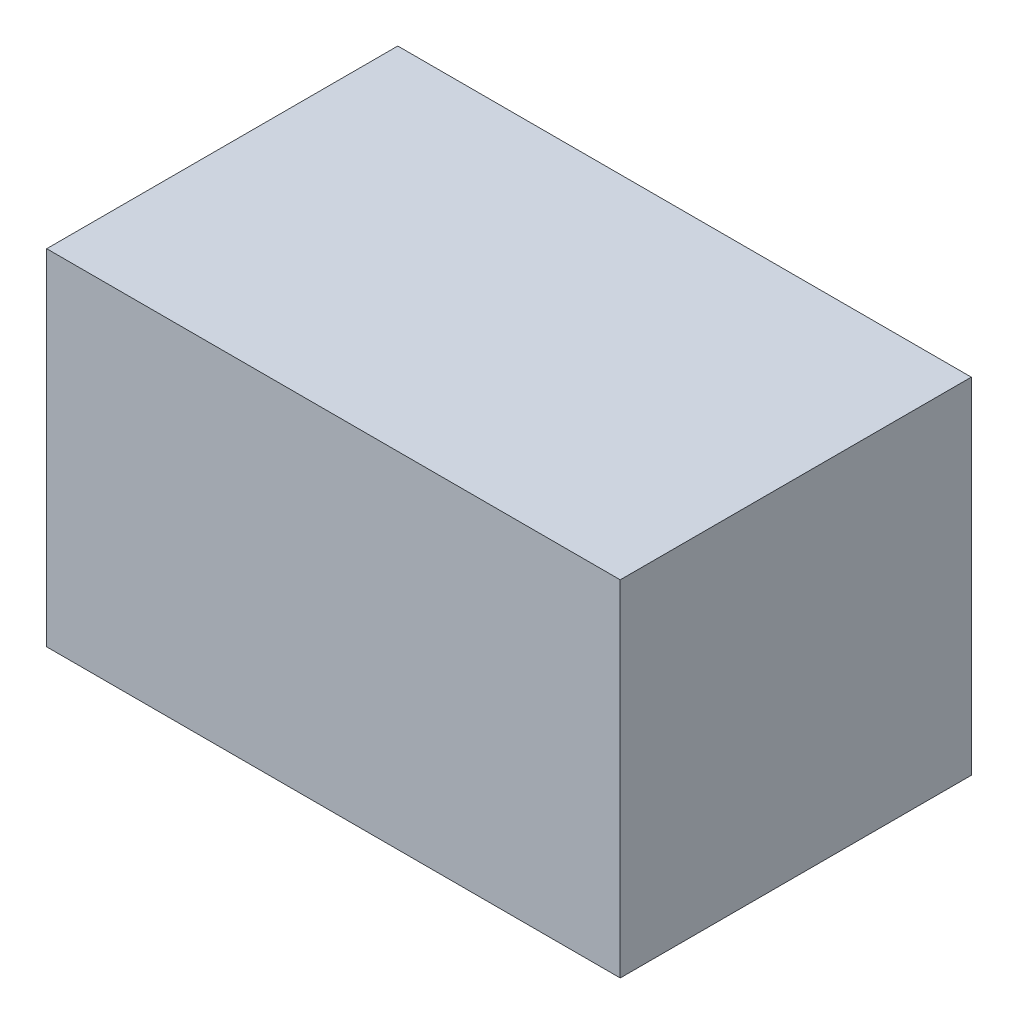
ISO-10303-21;
HEADER;
FILE_DESCRIPTION(('STEP AP214'),'2;1');
FILE_NAME('part.step','',(''),(''),'','','');
FILE_SCHEMA(('AUTOMOTIVE_DESIGN { 1 0 10303 214 1 1 1 1 }'));
ENDSEC;
DATA;
#1=APPLICATION_CONTEXT('core data for automotive mechanical design processes');
#2=APPLICATION_PROTOCOL_DEFINITION('international standard','automotive_design',2000,#1);
#3=PRODUCT_CONTEXT('',#1,'mechanical');
#4=PRODUCT('Part','Part','',(#3));
#5=PRODUCT_RELATED_PRODUCT_CATEGORY('part','',(#4));
#6=PRODUCT_DEFINITION_FORMATION('','',#4);
#7=PRODUCT_DEFINITION_CONTEXT('part definition',#1,'design');
#8=PRODUCT_DEFINITION('design','',#6,#7);
#9=PRODUCT_DEFINITION_SHAPE('','',#8);
#10=(LENGTH_UNIT() NAMED_UNIT(*) SI_UNIT(.MILLI.,.METRE.));
#11=(NAMED_UNIT(*) PLANE_ANGLE_UNIT() SI_UNIT($,.RADIAN.));
#12=(NAMED_UNIT(*) SI_UNIT($,.STERADIAN.) SOLID_ANGLE_UNIT());
#13=UNCERTAINTY_MEASURE_WITH_UNIT(LENGTH_MEASURE(1.E-05),#10,'distance_accuracy_value','');
#14=(GEOMETRIC_REPRESENTATION_CONTEXT(3) GLOBAL_UNCERTAINTY_ASSIGNED_CONTEXT((#13)) GLOBAL_UNIT_ASSIGNED_CONTEXT((#10,
#11,#12)) REPRESENTATION_CONTEXT('',''));
#15=CARTESIAN_POINT('',(0.,0.,0.));
#16=DIRECTION('',(0.,0.,1.));
#17=DIRECTION('',(1.,0.,0.));
#18=AXIS2_PLACEMENT_3D('',#15,#16,#17);
#19=CARTESIAN_POINT('',(-52.3519533877675,18.996599585239,101.044693299881));
#20=DIRECTION('',(-1.,0.,0.));
#21=DIRECTION('',(0.,-1.,0.));
#22=AXIS2_PLACEMENT_3D('',#19,#20,#21);
#23=PLANE('',#22);
#24=DIRECTION('',(0.,-1.,0.));
#25=VECTOR('',#24,1.);
#26=CARTESIAN_POINT('',(-52.3519533877675,18.996599585239,138.5));
#27=LINE('',#26,#25);
#28=CARTESIAN_POINT('',(-52.3519533877675,18.996599585239,138.5));
#29=VERTEX_POINT('',#28);
#30=CARTESIAN_POINT('',(-52.3519533877676,-0.303400414761136,138.5));
#31=VERTEX_POINT('',#30);
#32=EDGE_CURVE('E82',#29,#31,#27,.T.);
#33=ORIENTED_EDGE('',*,*,#32,.F.);
#34=DIRECTION('',(0.,0.,1.));
#35=VECTOR('',#34,1.);
#36=CARTESIAN_POINT('',(-52.3519533877675,18.996599585239,101.044693299881));
#37=LINE('',#36,#35);
#38=CARTESIAN_POINT('',(-52.3519533877675,18.9965995852389,158.149));
#39=VERTEX_POINT('',#38);
#40=EDGE_CURVE('E36',#29,#39,#37,.T.);
#41=ORIENTED_EDGE('',*,*,#40,.T.);
#42=DIRECTION('',(0.,-1.,0.));
#43=VECTOR('',#42,1.);
#44=CARTESIAN_POINT('',(-52.3519533877675,18.9965995852389,158.149));
#45=LINE('',#44,#43);
#46=CARTESIAN_POINT('',(-52.3519533877676,-0.303400414761142,158.149));
#47=VERTEX_POINT('',#46);
#48=EDGE_CURVE('E80',#39,#47,#45,.T.);
#49=ORIENTED_EDGE('',*,*,#48,.T.);
#50=DIRECTION('',(0.,0.,1.));
#51=VECTOR('',#50,1.);
#52=CARTESIAN_POINT('',(-52.3519533877676,-0.303400414761125,101.044693299881));
#53=LINE('',#52,#51);
#54=EDGE_CURVE('E71',#31,#47,#53,.T.);
#55=ORIENTED_EDGE('',*,*,#54,.F.);
#56=EDGE_LOOP('',(#33,#41,#49,#55));
#57=FACE_BOUND('',#56,.T.);
#58=ADVANCED_FACE('F32',(#57),#23,.F.);
#59=CARTESIAN_POINT('',(-52.3519533877676,-0.303400414761125,101.044693299881));
#60=DIRECTION('',(0.,1.,0.));
#61=DIRECTION('',(-1.,0.,0.));
#62=AXIS2_PLACEMENT_3D('',#59,#60,#61);
#63=PLANE('',#62);
#64=DIRECTION('',(-1.,0.,0.));
#65=VECTOR('',#64,1.);
#66=CARTESIAN_POINT('',(-52.3519533877676,-0.303400414761136,138.5));
#67=LINE('',#66,#65);
#68=CARTESIAN_POINT('',(-84.4519533877676,-0.303400414760996,138.5));
#69=VERTEX_POINT('',#68);
#70=EDGE_CURVE('E41',#31,#69,#67,.T.);
#71=ORIENTED_EDGE('',*,*,#70,.F.);
#72=ORIENTED_EDGE('',*,*,#54,.T.);
#73=DIRECTION('',(-1.,0.,0.));
#74=VECTOR('',#73,1.);
#75=CARTESIAN_POINT('',(-52.3519533877676,-0.303400414761142,158.149));
#76=LINE('',#75,#74);
#77=CARTESIAN_POINT('',(-84.4519533877676,-0.303400414761002,158.149));
#78=VERTEX_POINT('',#77);
#79=EDGE_CURVE('E92',#47,#78,#76,.T.);
#80=ORIENTED_EDGE('',*,*,#79,.T.);
#81=DIRECTION('',(0.,0.,1.));
#82=VECTOR('',#81,1.);
#83=CARTESIAN_POINT('',(-84.4519533877676,-0.303400414760984,101.044693299881));
#84=LINE('',#83,#82);
#85=EDGE_CURVE('E101',#69,#78,#84,.T.);
#86=ORIENTED_EDGE('',*,*,#85,.F.);
#87=EDGE_LOOP('',(#71,#72,#80,#86));
#88=FACE_BOUND('',#87,.T.);
#89=ADVANCED_FACE('F105',(#88),#63,.F.);
#90=CARTESIAN_POINT('',(-84.4519533877675,18.9965995852391,101.044693299881));
#91=DIRECTION('',(1.,0.,0.));
#92=DIRECTION('',(0.,1.,0.));
#93=AXIS2_PLACEMENT_3D('',#90,#91,#92);
#94=PLANE('',#93);
#95=DIRECTION('',(0.,1.,0.));
#96=VECTOR('',#95,1.);
#97=CARTESIAN_POINT('',(-84.4519533877675,18.9965995852391,138.5));
#98=LINE('',#97,#96);
#99=CARTESIAN_POINT('',(-84.4519533877675,18.9965995852391,138.5));
#100=VERTEX_POINT('',#99);
#101=EDGE_CURVE('E11',#69,#100,#98,.T.);
#102=ORIENTED_EDGE('',*,*,#101,.F.);
#103=ORIENTED_EDGE('',*,*,#85,.T.);
#104=DIRECTION('',(0.,1.,0.));
#105=VECTOR('',#104,1.);
#106=CARTESIAN_POINT('',(-84.4519533877675,18.9965995852391,158.149));
#107=LINE('',#106,#105);
#108=CARTESIAN_POINT('',(-84.4519533877675,18.9965995852391,158.149));
#109=VERTEX_POINT('',#108);
#110=EDGE_CURVE('E102',#78,#109,#107,.T.);
#111=ORIENTED_EDGE('',*,*,#110,.T.);
#112=DIRECTION('',(0.,0.,1.));
#113=VECTOR('',#112,1.);
#114=CARTESIAN_POINT('',(-84.4519533877675,18.9965995852391,101.044693299881));
#115=LINE('',#114,#113);
#116=EDGE_CURVE('E54',#100,#109,#115,.T.);
#117=ORIENTED_EDGE('',*,*,#116,.F.);
#118=EDGE_LOOP('',(#102,#103,#111,#117));
#119=FACE_BOUND('',#118,.T.);
#120=ADVANCED_FACE('F104',(#119),#94,.F.);
#121=CARTESIAN_POINT('',(-52.3519533877675,18.996599585239,101.044693299881));
#122=DIRECTION('',(0.,-1.,0.));
#123=DIRECTION('',(1.,0.,0.));
#124=AXIS2_PLACEMENT_3D('',#121,#122,#123);
#125=PLANE('',#124);
#126=DIRECTION('',(1.,0.,0.));
#127=VECTOR('',#126,1.);
#128=CARTESIAN_POINT('',(-52.3519533877675,18.996599585239,138.5));
#129=LINE('',#128,#127);
#130=EDGE_CURVE('E89',#100,#29,#129,.T.);
#131=ORIENTED_EDGE('',*,*,#130,.F.);
#132=ORIENTED_EDGE('',*,*,#116,.T.);
#133=DIRECTION('',(1.,0.,0.));
#134=VECTOR('',#133,1.);
#135=CARTESIAN_POINT('',(-52.3519533877675,18.9965995852389,158.149));
#136=LINE('',#135,#134);
#137=EDGE_CURVE('E85',#109,#39,#136,.T.);
#138=ORIENTED_EDGE('',*,*,#137,.T.);
#139=ORIENTED_EDGE('',*,*,#40,.F.);
#140=EDGE_LOOP('',(#131,#132,#138,#139));
#141=FACE_BOUND('',#140,.T.);
#142=ADVANCED_FACE('F86',(#141),#125,.F.);
#143=CARTESIAN_POINT('',(0.,0.,158.149));
#144=DIRECTION('',(0.,0.,-1.));
#145=DIRECTION('',(-1.,0.,0.));
#146=AXIS2_PLACEMENT_3D('',#143,#144,#145);
#147=PLANE('',#146);
#148=ORIENTED_EDGE('',*,*,#48,.F.);
#149=ORIENTED_EDGE('',*,*,#137,.F.);
#150=ORIENTED_EDGE('',*,*,#110,.F.);
#151=ORIENTED_EDGE('',*,*,#79,.F.);
#152=EDGE_LOOP('',(#148,#149,#150,#151));
#153=FACE_BOUND('',#152,.T.);
#154=ADVANCED_FACE('F91',(#153),#147,.F.);
#155=CARTESIAN_POINT('',(39.9502909734955,-6.20340041475944,138.5));
#156=DIRECTION('',(0.,0.,-1.));
#157=DIRECTION('',(-1.,0.,0.));
#158=AXIS2_PLACEMENT_3D('',#155,#156,#157);
#159=PLANE('',#158);
#160=ORIENTED_EDGE('',*,*,#130,.T.);
#161=ORIENTED_EDGE('',*,*,#32,.T.);
#162=ORIENTED_EDGE('',*,*,#70,.T.);
#163=ORIENTED_EDGE('',*,*,#101,.T.);
#164=EDGE_LOOP('',(#160,#161,#162,#163));
#165=FACE_BOUND('',#164,.T.);
#166=ADVANCED_FACE('F34',(#165),#159,.T.);
#167=CLOSED_SHELL('',(#58,#89,#120,#142,#154,#166));
#168=MANIFOLD_SOLID_BREP('B2',#167);
#169=ADVANCED_BREP_SHAPE_REPRESENTATION('',(#18,#168),#14);
#170=SHAPE_DEFINITION_REPRESENTATION(#9,#169);
ENDSEC;
END-ISO-10303-21;
